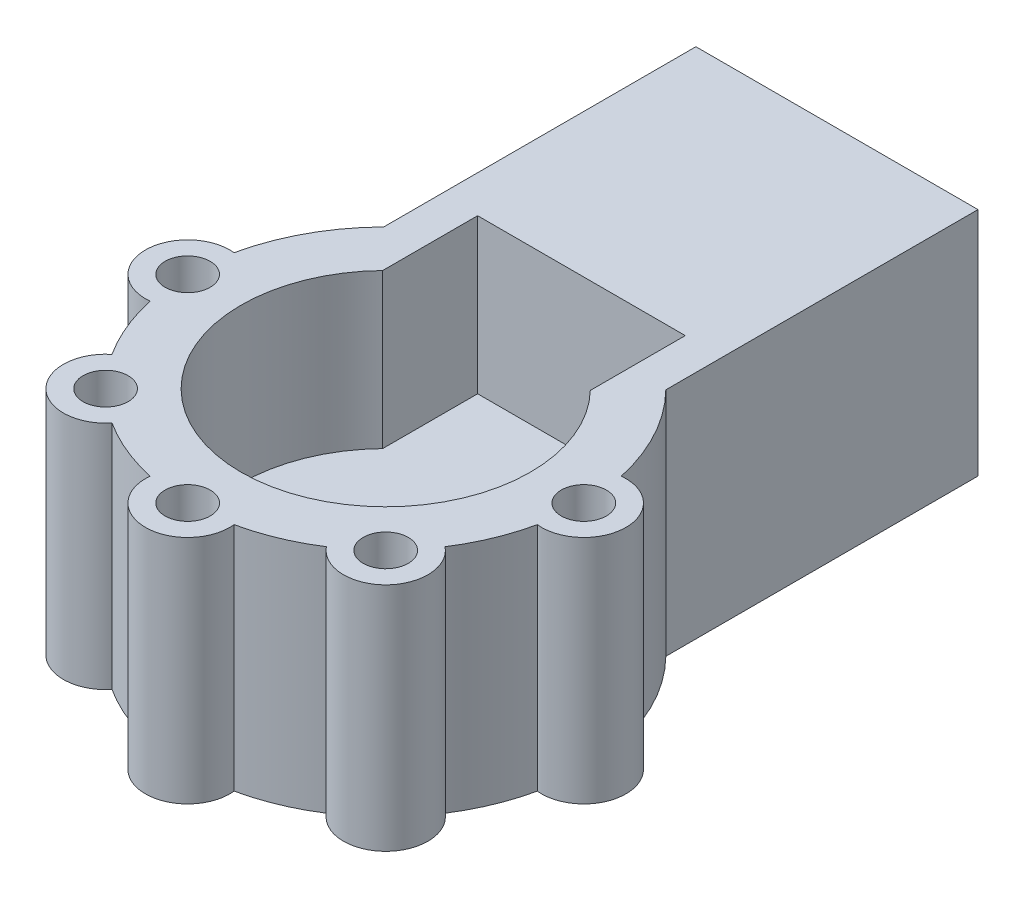
ISO-10303-21;
HEADER;
FILE_DESCRIPTION(('STEP AP214'),'2;1');
FILE_NAME('part.step','',(''),(''),'','','');
FILE_SCHEMA(('AUTOMOTIVE_DESIGN { 1 0 10303 214 1 1 1 1 }'));
ENDSEC;
DATA;
#1=APPLICATION_CONTEXT('core data for automotive mechanical design processes');
#2=APPLICATION_PROTOCOL_DEFINITION('international standard','automotive_design',2000,#1);
#3=PRODUCT_CONTEXT('',#1,'mechanical');
#4=PRODUCT('Part','Part','',(#3));
#5=PRODUCT_RELATED_PRODUCT_CATEGORY('part','',(#4));
#6=PRODUCT_DEFINITION_FORMATION('','',#4);
#7=PRODUCT_DEFINITION_CONTEXT('part definition',#1,'design');
#8=PRODUCT_DEFINITION('design','',#6,#7);
#9=PRODUCT_DEFINITION_SHAPE('','',#8);
#10=(LENGTH_UNIT() NAMED_UNIT(*) SI_UNIT(.MILLI.,.METRE.));
#11=(NAMED_UNIT(*) PLANE_ANGLE_UNIT() SI_UNIT($,.RADIAN.));
#12=(NAMED_UNIT(*) SI_UNIT($,.STERADIAN.) SOLID_ANGLE_UNIT());
#13=UNCERTAINTY_MEASURE_WITH_UNIT(LENGTH_MEASURE(1.E-05),#10,'distance_accuracy_value','');
#14=(GEOMETRIC_REPRESENTATION_CONTEXT(3) GLOBAL_UNCERTAINTY_ASSIGNED_CONTEXT((#13)) GLOBAL_UNIT_ASSIGNED_CONTEXT((#10,
#11,#12)) REPRESENTATION_CONTEXT('',''));
#15=CARTESIAN_POINT('',(0.,0.,0.));
#16=DIRECTION('',(0.,0.,1.));
#17=DIRECTION('',(1.,0.,0.));
#18=AXIS2_PLACEMENT_3D('',#15,#16,#17);
#19=CARTESIAN_POINT('',(-72.4336404409439,59.2626048963925,125.));
#20=DIRECTION('',(0.,-1.,0.));
#21=DIRECTION('',(0.,0.,-1.));
#22=AXIS2_PLACEMENT_3D('',#19,#20,#21);
#23=PLANE('',#22);
#24=CARTESIAN_POINT('',(71.9237510236151,59.2626048963925,303.64297723897));
#25=DIRECTION('',(0.,1.,0.));
#26=DIRECTION('',(0.,0.,1.));
#27=AXIS2_PLACEMENT_3D('',#24,#25,#26);
#28=CIRCLE('',#27,11.5757003126509);
#29=CARTESIAN_POINT('',(71.9237510236151,59.2626048963925,315.218677551621));
#30=VERTEX_POINT('',#29);
#31=EDGE_CURVE('E186',#30,#30,#28,.T.);
#32=ORIENTED_EDGE('',*,*,#31,.F.);
#33=EDGE_LOOP('',(#32));
#34=FACE_BOUND('',#33,.T.);
#35=CARTESIAN_POINT('',(101.715544154344,59.2626048963925,231.719226215354));
#36=DIRECTION('',(0.,1.,0.));
#37=DIRECTION('',(0.,0.,1.));
#38=AXIS2_PLACEMENT_3D('',#35,#36,#37);
#39=CIRCLE('',#38,11.5757003126509);
#40=CARTESIAN_POINT('',(101.715544154344,59.2626048963925,243.294926528005));
#41=VERTEX_POINT('',#40);
#42=EDGE_CURVE('E190',#41,#41,#39,.T.);
#43=ORIENTED_EDGE('',*,*,#42,.F.);
#44=EDGE_LOOP('',(#43));
#45=FACE_BOUND('',#44,.T.);
#46=CARTESIAN_POINT('',(-101.715544154344,59.2626048963925,231.719226215353));
#47=DIRECTION('',(0.,1.,0.));
#48=DIRECTION('',(0.,0.,1.));
#49=AXIS2_PLACEMENT_3D('',#46,#47,#48);
#50=CIRCLE('',#49,11.5757003126509);
#51=CARTESIAN_POINT('',(-101.715544154344,59.2626048963925,243.294926528004));
#52=VERTEX_POINT('',#51);
#53=EDGE_CURVE('E235',#52,#52,#50,.T.);
#54=ORIENTED_EDGE('',*,*,#53,.F.);
#55=EDGE_LOOP('',(#54));
#56=FACE_BOUND('',#55,.T.);
#57=CARTESIAN_POINT('',(-71.9237510236161,59.2626048963925,303.642977238969));
#58=DIRECTION('',(0.,1.,0.));
#59=DIRECTION('',(0.,0.,1.));
#60=AXIS2_PLACEMENT_3D('',#57,#58,#59);
#61=CIRCLE('',#60,11.5757003126509);
#62=CARTESIAN_POINT('',(-71.9237510236161,59.2626048963925,315.21867755162));
#63=VERTEX_POINT('',#62);
#64=EDGE_CURVE('E238',#63,#63,#61,.T.);
#65=ORIENTED_EDGE('',*,*,#64,.F.);
#66=EDGE_LOOP('',(#65));
#67=FACE_BOUND('',#66,.T.);
#68=CARTESIAN_POINT('',(0.,59.2626048963925,333.434770369697));
#69=DIRECTION('',(0.,1.,0.));
#70=DIRECTION('',(0.,0.,1.));
#71=AXIS2_PLACEMENT_3D('',#68,#69,#70);
#72=CIRCLE('',#71,11.5757003126509);
#73=CARTESIAN_POINT('',(0.,59.2626048963925,345.010470682348));
#74=VERTEX_POINT('',#73);
#75=EDGE_CURVE('E241',#74,#74,#72,.T.);
#76=ORIENTED_EDGE('',*,*,#75,.F.);
#77=EDGE_LOOP('',(#76));
#78=FACE_BOUND('',#77,.T.);
#79=DIRECTION('',(0.,0.,-1.));
#80=VECTOR('',#79,1.);
#81=CARTESIAN_POINT('',(-72.4336404409439,59.2626048963925,125.));
#82=LINE('',#81,#80);
#83=CARTESIAN_POINT('',(-72.4336404409439,59.2626048963925,0.));
#84=VERTEX_POINT('',#83);
#85=CARTESIAN_POINT('',(-72.4336404409439,59.2626048963925,160.309005272646));
#86=VERTEX_POINT('',#85);
#87=EDGE_CURVE('E42',#84,#86,#82,.F.);
#88=ORIENTED_EDGE('',*,*,#87,.T.);
#89=CARTESIAN_POINT('',(0.,59.2626048963925,231.719226215353));
#90=DIRECTION('',(0.,1.,0.));
#91=DIRECTION('',(0.,0.,1.));
#92=AXIS2_PLACEMENT_3D('',#89,#90,#91);
#93=CIRCLE('',#92,101.715544154344);
#94=CARTESIAN_POINT('',(-99.4043282418894,59.2626048963925,210.159276090343));
#95=VERTEX_POINT('',#94);
#96=EDGE_CURVE('E268',#86,#95,#93,.T.);
#97=ORIENTED_EDGE('',*,*,#96,.T.);
#98=CARTESIAN_POINT('',(-101.715544154344,59.2626048963925,231.719226215353));
#99=DIRECTION('',(0.,1.,0.));
#100=DIRECTION('',(0.,0.,1.));
#101=AXIS2_PLACEMENT_3D('',#98,#99,#100);
#102=CIRCLE('',#101,21.6834768518998);
#103=CARTESIAN_POINT('',(-99.4043282418896,59.2626048963925,253.279176340362));
#104=VERTEX_POINT('',#103);
#105=EDGE_CURVE('E272',#95,#104,#102,.T.);
#106=ORIENTED_EDGE('',*,*,#105,.T.);
#107=CARTESIAN_POINT('',(0.,59.2626048963925,231.719226215353));
#108=DIRECTION('',(0.,1.,0.));
#109=DIRECTION('',(0.,0.,1.));
#110=AXIS2_PLACEMENT_3D('',#107,#108,#109);
#111=CIRCLE('',#110,101.715544154344);
#112=CARTESIAN_POINT('',(-85.5346615145714,59.2626048963925,286.763513859049));
#113=VERTEX_POINT('',#112);
#114=EDGE_CURVE('E244',#104,#113,#111,.T.);
#115=ORIENTED_EDGE('',*,*,#114,.T.);
#116=CARTESIAN_POINT('',(-71.9237510236161,59.2626048963925,303.642977238969));
#117=DIRECTION('',(0.,1.,0.));
#118=DIRECTION('',(0.,0.,1.));
#119=AXIS2_PLACEMENT_3D('',#116,#117,#118);
#120=CIRCLE('',#119,21.6834768518996);
#121=CARTESIAN_POINT('',(-55.0442876436959,59.2626048963925,317.253887729924));
#122=VERTEX_POINT('',#121);
#123=EDGE_CURVE('E247',#113,#122,#120,.T.);
#124=ORIENTED_EDGE('',*,*,#123,.T.);
#125=CARTESIAN_POINT('',(0.,59.2626048963925,231.719226215353));
#126=DIRECTION('',(0.,1.,0.));
#127=DIRECTION('',(0.,0.,1.));
#128=AXIS2_PLACEMENT_3D('',#125,#126,#127);
#129=CIRCLE('',#128,101.715544154344);
#130=CARTESIAN_POINT('',(-21.5599501250093,59.2626048963925,331.123554457243));
#131=VERTEX_POINT('',#130);
#132=EDGE_CURVE('E250',#122,#131,#129,.T.);
#133=ORIENTED_EDGE('',*,*,#132,.T.);
#134=CARTESIAN_POINT('',(0.,59.2626048963925,333.434770369697));
#135=DIRECTION('',(0.,1.,0.));
#136=DIRECTION('',(0.,0.,1.));
#137=AXIS2_PLACEMENT_3D('',#134,#135,#136);
#138=CIRCLE('',#137,21.6834768518996);
#139=CARTESIAN_POINT('',(21.5599501250093,59.2626048963925,331.123554457243));
#140=VERTEX_POINT('',#139);
#141=EDGE_CURVE('E253',#131,#140,#138,.T.);
#142=ORIENTED_EDGE('',*,*,#141,.T.);
#143=CARTESIAN_POINT('',(0.,59.2626048963925,231.719226215353));
#144=DIRECTION('',(0.,1.,0.));
#145=DIRECTION('',(0.,0.,1.));
#146=AXIS2_PLACEMENT_3D('',#143,#144,#145);
#147=CIRCLE('',#146,101.715544154344);
#148=CARTESIAN_POINT('',(55.0442876436946,59.2626048963925,317.253887729925));
#149=VERTEX_POINT('',#148);
#150=EDGE_CURVE('E256',#140,#149,#147,.T.);
#151=ORIENTED_EDGE('',*,*,#150,.T.);
#152=CARTESIAN_POINT('',(71.9237510236151,59.2626048963925,303.64297723897));
#153=DIRECTION('',(0.,1.,0.));
#154=DIRECTION('',(0.,0.,1.));
#155=AXIS2_PLACEMENT_3D('',#152,#153,#154);
#156=CIRCLE('',#155,21.6834768518998);
#157=CARTESIAN_POINT('',(85.5346615145707,59.2626048963925,286.76351385905));
#158=VERTEX_POINT('',#157);
#159=EDGE_CURVE('E259',#149,#158,#156,.T.);
#160=ORIENTED_EDGE('',*,*,#159,.T.);
#161=CARTESIAN_POINT('',(0.,59.2626048963925,231.719226215353));
#162=DIRECTION('',(0.,1.,0.));
#163=DIRECTION('',(0.,0.,1.));
#164=AXIS2_PLACEMENT_3D('',#161,#162,#163);
#165=CIRCLE('',#164,101.715544154344);
#166=CARTESIAN_POINT('',(99.4043282418893,59.2626048963925,253.279176340364));
#167=VERTEX_POINT('',#166);
#168=EDGE_CURVE('E262',#158,#167,#165,.T.);
#169=ORIENTED_EDGE('',*,*,#168,.T.);
#170=CARTESIAN_POINT('',(101.715544154344,59.2626048963925,231.719226215354));
#171=DIRECTION('',(0.,1.,0.));
#172=DIRECTION('',(0.,0.,1.));
#173=AXIS2_PLACEMENT_3D('',#170,#171,#172);
#174=CIRCLE('',#173,21.6834768518998);
#175=CARTESIAN_POINT('',(99.4043282418898,59.2626048963925,210.159276090345));
#176=VERTEX_POINT('',#175);
#177=EDGE_CURVE('E265',#167,#176,#174,.T.);
#178=ORIENTED_EDGE('',*,*,#177,.T.);
#179=CARTESIAN_POINT('',(72.4336404409439,59.2626048963925,160.309005272646));
#180=VERTEX_POINT('',#179);
#181=EDGE_CURVE('E269',#176,#180,#93,.T.);
#182=ORIENTED_EDGE('',*,*,#181,.T.);
#183=DIRECTION('',(0.,0.,1.));
#184=VECTOR('',#183,1.);
#185=CARTESIAN_POINT('',(72.4336404409439,59.2626048963925,125.));
#186=LINE('',#185,#184);
#187=CARTESIAN_POINT('',(72.4336404409439,59.2626048963925,0.));
#188=VERTEX_POINT('',#187);
#189=EDGE_CURVE('E310',#180,#188,#186,.F.);
#190=ORIENTED_EDGE('',*,*,#189,.T.);
#191=DIRECTION('',(1.,0.,0.));
#192=VECTOR('',#191,1.);
#193=CARTESIAN_POINT('',(0.,59.2626048963925,0.));
#194=LINE('',#193,#192);
#195=EDGE_CURVE('E308',#188,#84,#194,.F.);
#196=ORIENTED_EDGE('',*,*,#195,.T.);
#197=EDGE_LOOP('',(#88,#97,#106,#115,#124,#133,#142,#151,#160,#169,#178,#182,#190,#196));
#198=FACE_BOUND('',#197,.T.);
#199=DIRECTION('',(0.,0.,-1.));
#200=VECTOR('',#199,1.);
#201=CARTESIAN_POINT('',(-53.3206547201814,59.2626048963925,179.962169425374));
#202=LINE('',#201,#200);
#203=CARTESIAN_POINT('',(-53.3206547201814,59.2626048963925,179.962169425374));
#204=VERTEX_POINT('',#203);
#205=CARTESIAN_POINT('',(-53.3206547201814,59.2626048963925,131.207582727193));
#206=VERTEX_POINT('',#205);
#207=EDGE_CURVE('E55',#204,#206,#202,.T.);
#208=ORIENTED_EDGE('',*,*,#207,.T.);
#209=DIRECTION('',(1.,0.,0.));
#210=VECTOR('',#209,1.);
#211=CARTESIAN_POINT('',(-53.3206547201814,59.2626048963925,131.207582727193));
#212=LINE('',#211,#210);
#213=CARTESIAN_POINT('',(53.3206547201814,59.2626048963925,131.207582727193));
#214=VERTEX_POINT('',#213);
#215=EDGE_CURVE('E185',#206,#214,#212,.T.);
#216=ORIENTED_EDGE('',*,*,#215,.T.);
#217=DIRECTION('',(0.,0.,-1.));
#218=VECTOR('',#217,1.);
#219=CARTESIAN_POINT('',(53.3206547201814,59.2626048963925,179.962169425374));
#220=LINE('',#219,#218);
#221=CARTESIAN_POINT('',(53.3206547201815,59.2626048963925,179.962169425374));
#222=VERTEX_POINT('',#221);
#223=EDGE_CURVE('E601',#222,#214,#220,.T.);
#224=ORIENTED_EDGE('',*,*,#223,.F.);
#225=CARTESIAN_POINT('',(0.,59.2626048963925,231.719226215353));
#226=DIRECTION('',(0.,1.,0.));
#227=DIRECTION('',(0.,0.,1.));
#228=AXIS2_PLACEMENT_3D('',#225,#226,#227);
#229=CIRCLE('',#228,74.3093880162522);
#230=EDGE_CURVE('E181',#204,#222,#229,.T.);
#231=ORIENTED_EDGE('',*,*,#230,.F.);
#232=EDGE_LOOP('',(#208,#216,#224,#231));
#233=FACE_BOUND('',#232,.T.);
#234=ADVANCED_FACE('F39',(#34,#45,#56,#67,#78,#198,#233),#23,.F.);
#235=CARTESIAN_POINT('',(-72.4336404409439,59.2626048963925,125.));
#236=DIRECTION('',(1.,0.,0.));
#237=DIRECTION('',(0.,0.,-1.));
#238=AXIS2_PLACEMENT_3D('',#235,#236,#237);
#239=PLANE('',#238);
#240=DIRECTION('',(0.,0.,1.));
#241=VECTOR('',#240,1.);
#242=CARTESIAN_POINT('',(-72.4336404409439,-59.2626048963925,125.));
#243=LINE('',#242,#241);
#244=CARTESIAN_POINT('',(-72.4336404409439,-59.2626048963925,0.));
#245=VERTEX_POINT('',#244);
#246=CARTESIAN_POINT('',(-72.4336404409439,-59.2626048963925,160.309005272646));
#247=VERTEX_POINT('',#246);
#248=EDGE_CURVE('E300',#245,#247,#243,.T.);
#249=ORIENTED_EDGE('',*,*,#248,.T.);
#250=DIRECTION('',(0.,1.,0.));
#251=VECTOR('',#250,1.);
#252=CARTESIAN_POINT('',(-72.4336404409439,-393.307274048045,160.309005272646));
#253=LINE('',#252,#251);
#254=EDGE_CURVE('E63',#247,#86,#253,.T.);
#255=ORIENTED_EDGE('',*,*,#254,.T.);
#256=ORIENTED_EDGE('',*,*,#87,.F.);
#257=DIRECTION('',(0.,1.,0.));
#258=VECTOR('',#257,1.);
#259=CARTESIAN_POINT('',(-72.4336404409439,0.,0.));
#260=LINE('',#259,#258);
#261=EDGE_CURVE('E305',#84,#245,#260,.F.);
#262=ORIENTED_EDGE('',*,*,#261,.T.);
#263=EDGE_LOOP('',(#249,#255,#256,#262));
#264=FACE_BOUND('',#263,.T.);
#265=ADVANCED_FACE('F380',(#264),#239,.F.);
#266=CARTESIAN_POINT('',(72.4336404409439,59.2626048963925,125.));
#267=DIRECTION('',(-1.,0.,0.));
#268=DIRECTION('',(0.,0.,1.));
#269=AXIS2_PLACEMENT_3D('',#266,#267,#268);
#270=PLANE('',#269);
#271=ORIENTED_EDGE('',*,*,#189,.F.);
#272=DIRECTION('',(0.,1.,0.));
#273=VECTOR('',#272,1.);
#274=CARTESIAN_POINT('',(72.4336404409439,-393.307274048045,160.309005272646));
#275=LINE('',#274,#273);
#276=CARTESIAN_POINT('',(72.4336404409439,-59.2626048963925,160.309005272646));
#277=VERTEX_POINT('',#276);
#278=EDGE_CURVE('E210',#180,#277,#275,.F.);
#279=ORIENTED_EDGE('',*,*,#278,.T.);
#280=DIRECTION('',(0.,0.,1.));
#281=VECTOR('',#280,1.);
#282=CARTESIAN_POINT('',(72.4336404409439,-59.2626048963925,125.));
#283=LINE('',#282,#281);
#284=CARTESIAN_POINT('',(72.4336404409439,-59.2626048963925,0.));
#285=VERTEX_POINT('',#284);
#286=EDGE_CURVE('E47',#277,#285,#283,.F.);
#287=ORIENTED_EDGE('',*,*,#286,.T.);
#288=DIRECTION('',(0.,1.,0.));
#289=VECTOR('',#288,1.);
#290=CARTESIAN_POINT('',(72.4336404409439,0.,0.));
#291=LINE('',#290,#289);
#292=EDGE_CURVE('E302',#285,#188,#291,.T.);
#293=ORIENTED_EDGE('',*,*,#292,.T.);
#294=EDGE_LOOP('',(#271,#279,#287,#293));
#295=FACE_BOUND('',#294,.T.);
#296=ADVANCED_FACE('F372',(#295),#270,.F.);
#297=CARTESIAN_POINT('',(0.,0.,0.));
#298=DIRECTION('',(0.,0.,1.));
#299=DIRECTION('',(1.,0.,0.));
#300=AXIS2_PLACEMENT_3D('',#297,#298,#299);
#301=PLANE('',#300);
#302=DIRECTION('',(1.,0.,0.));
#303=VECTOR('',#302,1.);
#304=CARTESIAN_POINT('',(-72.4336404409439,-59.2626048963925,0.));
#305=LINE('',#304,#303);
#306=EDGE_CURVE('E11',#285,#245,#305,.F.);
#307=ORIENTED_EDGE('',*,*,#306,.T.);
#308=ORIENTED_EDGE('',*,*,#261,.F.);
#309=ORIENTED_EDGE('',*,*,#195,.F.);
#310=ORIENTED_EDGE('',*,*,#292,.F.);
#311=EDGE_LOOP('',(#307,#308,#309,#310));
#312=FACE_BOUND('',#311,.T.);
#313=ADVANCED_FACE('F379',(#312),#301,.F.);
#314=CARTESIAN_POINT('',(-72.4336404409439,-59.2626048963925,125.));
#315=DIRECTION('',(0.,1.,0.));
#316=DIRECTION('',(0.,0.,1.));
#317=AXIS2_PLACEMENT_3D('',#314,#315,#316);
#318=PLANE('',#317);
#319=ORIENTED_EDGE('',*,*,#286,.F.);
#320=CARTESIAN_POINT('',(0.,-59.2626048963925,231.719226215353));
#321=DIRECTION('',(0.,1.,0.));
#322=DIRECTION('',(0.,0.,1.));
#323=AXIS2_PLACEMENT_3D('',#320,#321,#322);
#324=CIRCLE('',#323,101.715544154344);
#325=CARTESIAN_POINT('',(99.4043282418898,-59.2626048963925,210.159276090345));
#326=VERTEX_POINT('',#325);
#327=EDGE_CURVE('E226',#277,#326,#324,.F.);
#328=ORIENTED_EDGE('',*,*,#327,.T.);
#329=CARTESIAN_POINT('',(101.715544154344,-59.2626048963925,231.719226215354));
#330=DIRECTION('',(0.,1.,0.));
#331=DIRECTION('',(0.,0.,1.));
#332=AXIS2_PLACEMENT_3D('',#329,#330,#331);
#333=CIRCLE('',#332,21.6834768518998);
#334=CARTESIAN_POINT('',(99.4043282418893,-59.2626048963925,253.279176340364));
#335=VERTEX_POINT('',#334);
#336=EDGE_CURVE('E224',#326,#335,#333,.F.);
#337=ORIENTED_EDGE('',*,*,#336,.T.);
#338=CARTESIAN_POINT('',(0.,-59.2626048963925,231.719226215353));
#339=DIRECTION('',(0.,1.,0.));
#340=DIRECTION('',(0.,0.,1.));
#341=AXIS2_PLACEMENT_3D('',#338,#339,#340);
#342=CIRCLE('',#341,101.715544154344);
#343=CARTESIAN_POINT('',(85.5346615145707,-59.2626048963925,286.76351385905));
#344=VERTEX_POINT('',#343);
#345=EDGE_CURVE('E222',#335,#344,#342,.F.);
#346=ORIENTED_EDGE('',*,*,#345,.T.);
#347=CARTESIAN_POINT('',(71.9237510236151,-59.2626048963925,303.64297723897));
#348=DIRECTION('',(0.,1.,0.));
#349=DIRECTION('',(0.,0.,1.));
#350=AXIS2_PLACEMENT_3D('',#347,#348,#349);
#351=CIRCLE('',#350,21.6834768518998);
#352=CARTESIAN_POINT('',(55.0442876436946,-59.2626048963925,317.253887729925));
#353=VERTEX_POINT('',#352);
#354=EDGE_CURVE('E220',#344,#353,#351,.F.);
#355=ORIENTED_EDGE('',*,*,#354,.T.);
#356=CARTESIAN_POINT('',(0.,-59.2626048963925,231.719226215353));
#357=DIRECTION('',(0.,1.,0.));
#358=DIRECTION('',(0.,0.,1.));
#359=AXIS2_PLACEMENT_3D('',#356,#357,#358);
#360=CIRCLE('',#359,101.715544154344);
#361=CARTESIAN_POINT('',(21.5599501250093,-59.2626048963925,331.123554457243));
#362=VERTEX_POINT('',#361);
#363=EDGE_CURVE('E218',#353,#362,#360,.F.);
#364=ORIENTED_EDGE('',*,*,#363,.T.);
#365=CARTESIAN_POINT('',(0.,-59.2626048963925,333.434770369697));
#366=DIRECTION('',(0.,1.,0.));
#367=DIRECTION('',(0.,0.,1.));
#368=AXIS2_PLACEMENT_3D('',#365,#366,#367);
#369=CIRCLE('',#368,21.6834768518996);
#370=CARTESIAN_POINT('',(-21.5599501250093,-59.2626048963925,331.123554457243));
#371=VERTEX_POINT('',#370);
#372=EDGE_CURVE('E215',#362,#371,#369,.F.);
#373=ORIENTED_EDGE('',*,*,#372,.T.);
#374=CARTESIAN_POINT('',(0.,-59.2626048963925,231.719226215353));
#375=DIRECTION('',(0.,1.,0.));
#376=DIRECTION('',(0.,0.,1.));
#377=AXIS2_PLACEMENT_3D('',#374,#375,#376);
#378=CIRCLE('',#377,101.715544154344);
#379=CARTESIAN_POINT('',(-55.0442876436959,-59.2626048963925,317.253887729924));
#380=VERTEX_POINT('',#379);
#381=EDGE_CURVE('E213',#371,#380,#378,.F.);
#382=ORIENTED_EDGE('',*,*,#381,.T.);
#383=CARTESIAN_POINT('',(-71.9237510236161,-59.2626048963925,303.642977238969));
#384=DIRECTION('',(0.,1.,0.));
#385=DIRECTION('',(0.,0.,1.));
#386=AXIS2_PLACEMENT_3D('',#383,#384,#385);
#387=CIRCLE('',#386,21.6834768518996);
#388=CARTESIAN_POINT('',(-85.5346615145714,-59.2626048963925,286.763513859049));
#389=VERTEX_POINT('',#388);
#390=EDGE_CURVE('E207',#380,#389,#387,.F.);
#391=ORIENTED_EDGE('',*,*,#390,.T.);
#392=CARTESIAN_POINT('',(0.,-59.2626048963925,231.719226215353));
#393=DIRECTION('',(0.,1.,0.));
#394=DIRECTION('',(0.,0.,1.));
#395=AXIS2_PLACEMENT_3D('',#392,#393,#394);
#396=CIRCLE('',#395,101.715544154344);
#397=CARTESIAN_POINT('',(-99.4043282418896,-59.2626048963925,253.279176340362));
#398=VERTEX_POINT('',#397);
#399=EDGE_CURVE('E212',#389,#398,#396,.F.);
#400=ORIENTED_EDGE('',*,*,#399,.T.);
#401=CARTESIAN_POINT('',(-101.715544154344,-59.2626048963925,231.719226215353));
#402=DIRECTION('',(0.,1.,0.));
#403=DIRECTION('',(0.,0.,1.));
#404=AXIS2_PLACEMENT_3D('',#401,#402,#403);
#405=CIRCLE('',#404,21.6834768518998);
#406=CARTESIAN_POINT('',(-99.4043282418894,-59.2626048963925,210.159276090343));
#407=VERTEX_POINT('',#406);
#408=EDGE_CURVE('E230',#398,#407,#405,.F.);
#409=ORIENTED_EDGE('',*,*,#408,.T.);
#410=EDGE_CURVE('E227',#407,#247,#324,.F.);
#411=ORIENTED_EDGE('',*,*,#410,.T.);
#412=ORIENTED_EDGE('',*,*,#248,.F.);
#413=ORIENTED_EDGE('',*,*,#306,.F.);
#414=EDGE_LOOP('',(#319,#328,#337,#346,#355,#364,#373,#382,#391,#400,#409,#411,#412,#413));
#415=FACE_BOUND('',#414,.T.);
#416=CARTESIAN_POINT('',(0.,-59.2626048963925,333.434770369697));
#417=DIRECTION('',(0.,1.,0.));
#418=DIRECTION('',(0.,0.,1.));
#419=AXIS2_PLACEMENT_3D('',#416,#417,#418);
#420=CIRCLE('',#419,11.5757003126509);
#421=CARTESIAN_POINT('',(0.,-59.2626048963925,345.010470682348));
#422=VERTEX_POINT('',#421);
#423=EDGE_CURVE('E204',#422,#422,#420,.F.);
#424=ORIENTED_EDGE('',*,*,#423,.F.);
#425=EDGE_LOOP('',(#424));
#426=FACE_BOUND('',#425,.T.);
#427=CARTESIAN_POINT('',(-101.715544154344,-59.2626048963925,231.719226215353));
#428=DIRECTION('',(0.,1.,0.));
#429=DIRECTION('',(0.,0.,1.));
#430=AXIS2_PLACEMENT_3D('',#427,#428,#429);
#431=CIRCLE('',#430,11.5757003126509);
#432=CARTESIAN_POINT('',(-101.715544154344,-59.2626048963925,243.294926528004));
#433=VERTEX_POINT('',#432);
#434=EDGE_CURVE('E201',#433,#433,#431,.F.);
#435=ORIENTED_EDGE('',*,*,#434,.F.);
#436=EDGE_LOOP('',(#435));
#437=FACE_BOUND('',#436,.T.);
#438=CARTESIAN_POINT('',(71.9237510236151,-59.2626048963925,303.64297723897));
#439=DIRECTION('',(0.,1.,0.));
#440=DIRECTION('',(0.,0.,1.));
#441=AXIS2_PLACEMENT_3D('',#438,#439,#440);
#442=CIRCLE('',#441,11.5757003126509);
#443=CARTESIAN_POINT('',(71.9237510236151,-59.2626048963925,315.218677551621));
#444=VERTEX_POINT('',#443);
#445=EDGE_CURVE('E199',#444,#444,#442,.F.);
#446=ORIENTED_EDGE('',*,*,#445,.F.);
#447=EDGE_LOOP('',(#446));
#448=FACE_BOUND('',#447,.T.);
#449=CARTESIAN_POINT('',(101.715544154344,-59.2626048963925,231.719226215354));
#450=DIRECTION('',(0.,1.,0.));
#451=DIRECTION('',(0.,0.,1.));
#452=AXIS2_PLACEMENT_3D('',#449,#450,#451);
#453=CIRCLE('',#452,11.5757003126509);
#454=CARTESIAN_POINT('',(101.715544154344,-59.2626048963925,243.294926528005));
#455=VERTEX_POINT('',#454);
#456=EDGE_CURVE('E196',#455,#455,#453,.F.);
#457=ORIENTED_EDGE('',*,*,#456,.F.);
#458=EDGE_LOOP('',(#457));
#459=FACE_BOUND('',#458,.T.);
#460=CARTESIAN_POINT('',(-71.9237510236161,-59.2626048963925,303.642977238969));
#461=DIRECTION('',(0.,1.,0.));
#462=DIRECTION('',(0.,0.,1.));
#463=AXIS2_PLACEMENT_3D('',#460,#461,#462);
#464=CIRCLE('',#463,11.5757003126509);
#465=CARTESIAN_POINT('',(-71.9237510236161,-59.2626048963925,315.21867755162));
#466=VERTEX_POINT('',#465);
#467=EDGE_CURVE('E200',#466,#466,#464,.F.);
#468=ORIENTED_EDGE('',*,*,#467,.F.);
#469=EDGE_LOOP('',(#468));
#470=FACE_BOUND('',#469,.T.);
#471=ADVANCED_FACE('F376',(#415,#426,#437,#448,#459,#470),#318,.F.);
#472=CARTESIAN_POINT('',(0.,-393.307274048045,231.719226215353));
#473=DIRECTION('',(0.,1.,0.));
#474=DIRECTION('',(0.,0.,1.));
#475=AXIS2_PLACEMENT_3D('',#472,#473,#474);
#476=CYLINDRICAL_SURFACE('',#475,101.715544154344);
#477=ORIENTED_EDGE('',*,*,#254,.F.);
#478=ORIENTED_EDGE('',*,*,#410,.F.);
#479=DIRECTION('',(0.,1.,0.));
#480=VECTOR('',#479,1.);
#481=CARTESIAN_POINT('',(-99.4043282418894,-393.307274048045,210.159276090343));
#482=LINE('',#481,#480);
#483=EDGE_CURVE('E277',#407,#95,#482,.T.);
#484=ORIENTED_EDGE('',*,*,#483,.T.);
#485=ORIENTED_EDGE('',*,*,#96,.F.);
#486=EDGE_LOOP('',(#477,#478,#484,#485));
#487=FACE_BOUND('',#486,.T.);
#488=ADVANCED_FACE('F317',(#487),#476,.T.);
#489=ORIENTED_EDGE('',*,*,#278,.F.);
#490=ORIENTED_EDGE('',*,*,#181,.F.);
#491=DIRECTION('',(0.,1.,0.));
#492=VECTOR('',#491,1.);
#493=CARTESIAN_POINT('',(99.4043282418898,-393.307274048045,210.159276090345));
#494=LINE('',#493,#492);
#495=EDGE_CURVE('E280',#326,#176,#494,.T.);
#496=ORIENTED_EDGE('',*,*,#495,.F.);
#497=ORIENTED_EDGE('',*,*,#327,.F.);
#498=EDGE_LOOP('',(#489,#490,#496,#497));
#499=FACE_BOUND('',#498,.T.);
#500=ADVANCED_FACE('F369',(#499),#476,.T.);
#501=CARTESIAN_POINT('',(-71.9237510236161,-393.307274048045,303.642977238969));
#502=DIRECTION('',(0.,1.,0.));
#503=DIRECTION('',(0.,0.,1.));
#504=AXIS2_PLACEMENT_3D('',#501,#502,#503);
#505=CYLINDRICAL_SURFACE('',#504,21.6834768518996);
#506=ORIENTED_EDGE('',*,*,#390,.F.);
#507=DIRECTION('',(0.,1.,0.));
#508=VECTOR('',#507,1.);
#509=CARTESIAN_POINT('',(-55.0442876436959,-393.307274048045,317.253887729924));
#510=LINE('',#509,#508);
#511=EDGE_CURVE('E292',#380,#122,#510,.T.);
#512=ORIENTED_EDGE('',*,*,#511,.T.);
#513=ORIENTED_EDGE('',*,*,#123,.F.);
#514=DIRECTION('',(0.,1.,0.));
#515=VECTOR('',#514,1.);
#516=CARTESIAN_POINT('',(-85.5346615145714,-393.307274048045,286.763513859049));
#517=LINE('',#516,#515);
#518=EDGE_CURVE('E275',#389,#113,#517,.T.);
#519=ORIENTED_EDGE('',*,*,#518,.F.);
#520=EDGE_LOOP('',(#506,#512,#513,#519));
#521=FACE_BOUND('',#520,.T.);
#522=ADVANCED_FACE('F333',(#521),#505,.T.);
#523=CARTESIAN_POINT('',(0.,-393.307274048045,231.719226215353));
#524=DIRECTION('',(0.,1.,0.));
#525=DIRECTION('',(0.,0.,1.));
#526=AXIS2_PLACEMENT_3D('',#523,#524,#525);
#527=CYLINDRICAL_SURFACE('',#526,101.715544154344);
#528=ORIENTED_EDGE('',*,*,#381,.F.);
#529=DIRECTION('',(0.,1.,0.));
#530=VECTOR('',#529,1.);
#531=CARTESIAN_POINT('',(-21.5599501250093,-393.307274048045,331.123554457243));
#532=LINE('',#531,#530);
#533=EDGE_CURVE('E290',#371,#131,#532,.T.);
#534=ORIENTED_EDGE('',*,*,#533,.T.);
#535=ORIENTED_EDGE('',*,*,#132,.F.);
#536=ORIENTED_EDGE('',*,*,#511,.F.);
#537=EDGE_LOOP('',(#528,#534,#535,#536));
#538=FACE_BOUND('',#537,.T.);
#539=ADVANCED_FACE('F338',(#538),#527,.T.);
#540=CARTESIAN_POINT('',(0.,-393.307274048045,333.434770369697));
#541=DIRECTION('',(0.,1.,0.));
#542=DIRECTION('',(0.,0.,1.));
#543=AXIS2_PLACEMENT_3D('',#540,#541,#542);
#544=CYLINDRICAL_SURFACE('',#543,21.6834768518996);
#545=ORIENTED_EDGE('',*,*,#372,.F.);
#546=DIRECTION('',(0.,1.,0.));
#547=VECTOR('',#546,1.);
#548=CARTESIAN_POINT('',(21.5599501250093,-393.307274048045,331.123554457243));
#549=LINE('',#548,#547);
#550=EDGE_CURVE('E288',#362,#140,#549,.T.);
#551=ORIENTED_EDGE('',*,*,#550,.T.);
#552=ORIENTED_EDGE('',*,*,#141,.F.);
#553=ORIENTED_EDGE('',*,*,#533,.F.);
#554=EDGE_LOOP('',(#545,#551,#552,#553));
#555=FACE_BOUND('',#554,.T.);
#556=ADVANCED_FACE('F344',(#555),#544,.T.);
#557=CARTESIAN_POINT('',(0.,-393.307274048045,231.719226215353));
#558=DIRECTION('',(0.,1.,0.));
#559=DIRECTION('',(0.,0.,1.));
#560=AXIS2_PLACEMENT_3D('',#557,#558,#559);
#561=CYLINDRICAL_SURFACE('',#560,101.715544154344);
#562=ORIENTED_EDGE('',*,*,#363,.F.);
#563=DIRECTION('',(0.,1.,0.));
#564=VECTOR('',#563,1.);
#565=CARTESIAN_POINT('',(55.0442876436946,-393.307274048045,317.253887729925));
#566=LINE('',#565,#564);
#567=EDGE_CURVE('E286',#353,#149,#566,.T.);
#568=ORIENTED_EDGE('',*,*,#567,.T.);
#569=ORIENTED_EDGE('',*,*,#150,.F.);
#570=ORIENTED_EDGE('',*,*,#550,.F.);
#571=EDGE_LOOP('',(#562,#568,#569,#570));
#572=FACE_BOUND('',#571,.T.);
#573=ADVANCED_FACE('F348',(#572),#561,.T.);
#574=CARTESIAN_POINT('',(71.9237510236151,-393.307274048045,303.64297723897));
#575=DIRECTION('',(0.,1.,0.));
#576=DIRECTION('',(0.,0.,1.));
#577=AXIS2_PLACEMENT_3D('',#574,#575,#576);
#578=CYLINDRICAL_SURFACE('',#577,21.6834768518998);
#579=ORIENTED_EDGE('',*,*,#354,.F.);
#580=DIRECTION('',(0.,1.,0.));
#581=VECTOR('',#580,1.);
#582=CARTESIAN_POINT('',(85.5346615145707,-393.307274048045,286.76351385905));
#583=LINE('',#582,#581);
#584=EDGE_CURVE('E284',#344,#158,#583,.T.);
#585=ORIENTED_EDGE('',*,*,#584,.T.);
#586=ORIENTED_EDGE('',*,*,#159,.F.);
#587=ORIENTED_EDGE('',*,*,#567,.F.);
#588=EDGE_LOOP('',(#579,#585,#586,#587));
#589=FACE_BOUND('',#588,.T.);
#590=ADVANCED_FACE('F353',(#589),#578,.T.);
#591=CARTESIAN_POINT('',(0.,-393.307274048045,231.719226215353));
#592=DIRECTION('',(0.,1.,0.));
#593=DIRECTION('',(0.,0.,1.));
#594=AXIS2_PLACEMENT_3D('',#591,#592,#593);
#595=CYLINDRICAL_SURFACE('',#594,101.715544154344);
#596=ORIENTED_EDGE('',*,*,#345,.F.);
#597=DIRECTION('',(0.,1.,0.));
#598=VECTOR('',#597,1.);
#599=CARTESIAN_POINT('',(99.4043282418893,-393.307274048045,253.279176340364));
#600=LINE('',#599,#598);
#601=EDGE_CURVE('E282',#335,#167,#600,.T.);
#602=ORIENTED_EDGE('',*,*,#601,.T.);
#603=ORIENTED_EDGE('',*,*,#168,.F.);
#604=ORIENTED_EDGE('',*,*,#584,.F.);
#605=EDGE_LOOP('',(#596,#602,#603,#604));
#606=FACE_BOUND('',#605,.T.);
#607=ADVANCED_FACE('F359',(#606),#595,.T.);
#608=CARTESIAN_POINT('',(101.715544154344,-393.307274048045,231.719226215354));
#609=DIRECTION('',(0.,1.,0.));
#610=DIRECTION('',(0.,0.,1.));
#611=AXIS2_PLACEMENT_3D('',#608,#609,#610);
#612=CYLINDRICAL_SURFACE('',#611,21.6834768518998);
#613=ORIENTED_EDGE('',*,*,#336,.F.);
#614=ORIENTED_EDGE('',*,*,#495,.T.);
#615=ORIENTED_EDGE('',*,*,#177,.F.);
#616=ORIENTED_EDGE('',*,*,#601,.F.);
#617=EDGE_LOOP('',(#613,#614,#615,#616));
#618=FACE_BOUND('',#617,.T.);
#619=ADVANCED_FACE('F363',(#618),#612,.T.);
#620=CARTESIAN_POINT('',(-101.715544154344,-393.307274048045,231.719226215353));
#621=DIRECTION('',(0.,1.,0.));
#622=DIRECTION('',(0.,0.,1.));
#623=AXIS2_PLACEMENT_3D('',#620,#621,#622);
#624=CYLINDRICAL_SURFACE('',#623,21.6834768518998);
#625=ORIENTED_EDGE('',*,*,#408,.F.);
#626=DIRECTION('',(0.,1.,0.));
#627=VECTOR('',#626,1.);
#628=CARTESIAN_POINT('',(-99.4043282418896,-393.307274048045,253.279176340362));
#629=LINE('',#628,#627);
#630=EDGE_CURVE('E216',#398,#104,#629,.T.);
#631=ORIENTED_EDGE('',*,*,#630,.T.);
#632=ORIENTED_EDGE('',*,*,#105,.F.);
#633=ORIENTED_EDGE('',*,*,#483,.F.);
#634=EDGE_LOOP('',(#625,#631,#632,#633));
#635=FACE_BOUND('',#634,.T.);
#636=ADVANCED_FACE('F323',(#635),#624,.T.);
#637=CARTESIAN_POINT('',(0.,-393.307274048045,231.719226215353));
#638=DIRECTION('',(0.,1.,0.));
#639=DIRECTION('',(0.,0.,1.));
#640=AXIS2_PLACEMENT_3D('',#637,#638,#639);
#641=CYLINDRICAL_SURFACE('',#640,101.715544154344);
#642=ORIENTED_EDGE('',*,*,#399,.F.);
#643=ORIENTED_EDGE('',*,*,#518,.T.);
#644=ORIENTED_EDGE('',*,*,#114,.F.);
#645=ORIENTED_EDGE('',*,*,#630,.F.);
#646=EDGE_LOOP('',(#642,#643,#644,#645));
#647=FACE_BOUND('',#646,.T.);
#648=ADVANCED_FACE('F329',(#647),#641,.T.);
#649=CARTESIAN_POINT('',(0.,-393.307274048045,333.434770369697));
#650=DIRECTION('',(0.,1.,0.));
#651=DIRECTION('',(0.,0.,1.));
#652=AXIS2_PLACEMENT_3D('',#649,#650,#651);
#653=CYLINDRICAL_SURFACE('',#652,11.5757003126509);
#654=ORIENTED_EDGE('',*,*,#423,.T.);
#655=EDGE_LOOP('',(#654));
#656=FACE_BOUND('',#655,.T.);
#657=ORIENTED_EDGE('',*,*,#75,.T.);
#658=EDGE_LOOP('',(#657));
#659=FACE_BOUND('',#658,.T.);
#660=ADVANCED_FACE('F413',(#656,#659),#653,.F.);
#661=CARTESIAN_POINT('',(-71.9237510236161,-393.307274048045,303.642977238969));
#662=DIRECTION('',(0.,1.,0.));
#663=DIRECTION('',(0.,0.,1.));
#664=AXIS2_PLACEMENT_3D('',#661,#662,#663);
#665=CYLINDRICAL_SURFACE('',#664,11.5757003126509);
#666=ORIENTED_EDGE('',*,*,#467,.T.);
#667=EDGE_LOOP('',(#666));
#668=FACE_BOUND('',#667,.T.);
#669=ORIENTED_EDGE('',*,*,#64,.T.);
#670=EDGE_LOOP('',(#669));
#671=FACE_BOUND('',#670,.T.);
#672=ADVANCED_FACE('F503',(#668,#671),#665,.F.);
#673=CARTESIAN_POINT('',(-101.715544154344,-393.307274048045,231.719226215353));
#674=DIRECTION('',(0.,1.,0.));
#675=DIRECTION('',(0.,0.,1.));
#676=AXIS2_PLACEMENT_3D('',#673,#674,#675);
#677=CYLINDRICAL_SURFACE('',#676,11.5757003126509);
#678=ORIENTED_EDGE('',*,*,#434,.T.);
#679=EDGE_LOOP('',(#678));
#680=FACE_BOUND('',#679,.T.);
#681=ORIENTED_EDGE('',*,*,#53,.T.);
#682=EDGE_LOOP('',(#681));
#683=FACE_BOUND('',#682,.T.);
#684=ADVANCED_FACE('F512',(#680,#683),#677,.F.);
#685=CARTESIAN_POINT('',(101.715544154344,-393.307274048045,231.719226215354));
#686=DIRECTION('',(0.,1.,0.));
#687=DIRECTION('',(0.,0.,1.));
#688=AXIS2_PLACEMENT_3D('',#685,#686,#687);
#689=CYLINDRICAL_SURFACE('',#688,11.5757003126509);
#690=ORIENTED_EDGE('',*,*,#456,.T.);
#691=EDGE_LOOP('',(#690));
#692=FACE_BOUND('',#691,.T.);
#693=ORIENTED_EDGE('',*,*,#42,.T.);
#694=EDGE_LOOP('',(#693));
#695=FACE_BOUND('',#694,.T.);
#696=ADVANCED_FACE('F522',(#692,#695),#689,.F.);
#697=CARTESIAN_POINT('',(71.9237510236151,-393.307274048045,303.64297723897));
#698=DIRECTION('',(0.,1.,0.));
#699=DIRECTION('',(0.,0.,1.));
#700=AXIS2_PLACEMENT_3D('',#697,#698,#699);
#701=CYLINDRICAL_SURFACE('',#700,11.5757003126509);
#702=ORIENTED_EDGE('',*,*,#445,.T.);
#703=EDGE_LOOP('',(#702));
#704=FACE_BOUND('',#703,.T.);
#705=ORIENTED_EDGE('',*,*,#31,.T.);
#706=EDGE_LOOP('',(#705));
#707=FACE_BOUND('',#706,.T.);
#708=ADVANCED_FACE('F532',(#704,#707),#701,.F.);
#709=CARTESIAN_POINT('',(-53.3206547201814,-19.9373951036075,179.962169425374));
#710=DIRECTION('',(1.,0.,0.));
#711=DIRECTION('',(0.,0.,-1.));
#712=AXIS2_PLACEMENT_3D('',#709,#710,#711);
#713=PLANE('',#712);
#714=ORIENTED_EDGE('',*,*,#207,.F.);
#715=DIRECTION('',(0.,1.,0.));
#716=VECTOR('',#715,1.);
#717=CARTESIAN_POINT('',(-53.3206547201814,-19.9373951036075,179.962169425374));
#718=LINE('',#717,#716);
#719=CARTESIAN_POINT('',(-53.3206547201814,-19.9373951036075,179.962169425374));
#720=VERTEX_POINT('',#719);
#721=EDGE_CURVE('E180',#720,#204,#718,.T.);
#722=ORIENTED_EDGE('',*,*,#721,.F.);
#723=DIRECTION('',(0.,0.,-1.));
#724=VECTOR('',#723,1.);
#725=CARTESIAN_POINT('',(-53.3206547201814,-19.9373951036075,179.962169425374));
#726=LINE('',#725,#724);
#727=CARTESIAN_POINT('',(-53.3206547201814,-19.9373951036075,131.207582727193));
#728=VERTEX_POINT('',#727);
#729=EDGE_CURVE('E170',#720,#728,#726,.T.);
#730=ORIENTED_EDGE('',*,*,#729,.T.);
#731=DIRECTION('',(0.,1.,0.));
#732=VECTOR('',#731,1.);
#733=CARTESIAN_POINT('',(-53.3206547201814,-19.9373951036075,131.207582727193));
#734=LINE('',#733,#732);
#735=EDGE_CURVE('E179',#728,#206,#734,.T.);
#736=ORIENTED_EDGE('',*,*,#735,.T.);
#737=EDGE_LOOP('',(#714,#722,#730,#736));
#738=FACE_BOUND('',#737,.T.);
#739=ADVANCED_FACE('F178',(#738),#713,.T.);
#740=CARTESIAN_POINT('',(-53.3206547201814,-19.9373951036075,131.207582727193));
#741=DIRECTION('',(0.,0.,1.));
#742=DIRECTION('',(1.,0.,0.));
#743=AXIS2_PLACEMENT_3D('',#740,#741,#742);
#744=PLANE('',#743);
#745=ORIENTED_EDGE('',*,*,#215,.F.);
#746=ORIENTED_EDGE('',*,*,#735,.F.);
#747=DIRECTION('',(1.,0.,0.));
#748=VECTOR('',#747,1.);
#749=CARTESIAN_POINT('',(-53.3206547201814,-19.9373951036075,131.207582727193));
#750=LINE('',#749,#748);
#751=CARTESIAN_POINT('',(53.3206547201814,-19.9373951036075,131.207582727193));
#752=VERTEX_POINT('',#751);
#753=EDGE_CURVE('E166',#728,#752,#750,.T.);
#754=ORIENTED_EDGE('',*,*,#753,.T.);
#755=DIRECTION('',(0.,1.,0.));
#756=VECTOR('',#755,1.);
#757=CARTESIAN_POINT('',(53.3206547201814,-19.9373951036075,131.207582727193));
#758=LINE('',#757,#756);
#759=EDGE_CURVE('E187',#752,#214,#758,.T.);
#760=ORIENTED_EDGE('',*,*,#759,.T.);
#761=EDGE_LOOP('',(#745,#746,#754,#760));
#762=FACE_BOUND('',#761,.T.);
#763=ADVANCED_FACE('F183',(#762),#744,.T.);
#764=CARTESIAN_POINT('',(53.3206547201814,-19.9373951036075,179.962169425374));
#765=DIRECTION('',(1.,0.,0.));
#766=DIRECTION('',(0.,0.,-1.));
#767=AXIS2_PLACEMENT_3D('',#764,#765,#766);
#768=PLANE('',#767);
#769=ORIENTED_EDGE('',*,*,#223,.T.);
#770=ORIENTED_EDGE('',*,*,#759,.F.);
#771=DIRECTION('',(0.,0.,-1.));
#772=VECTOR('',#771,1.);
#773=CARTESIAN_POINT('',(53.3206547201814,-19.9373951036075,179.962169425374));
#774=LINE('',#773,#772);
#775=CARTESIAN_POINT('',(53.3206547201815,-19.9373951036075,179.962169425374));
#776=VERTEX_POINT('',#775);
#777=EDGE_CURVE('E173',#776,#752,#774,.T.);
#778=ORIENTED_EDGE('',*,*,#777,.F.);
#779=DIRECTION('',(0.,1.,0.));
#780=VECTOR('',#779,1.);
#781=CARTESIAN_POINT('',(53.3206547201815,-19.9373951036075,179.962169425374));
#782=LINE('',#781,#780);
#783=EDGE_CURVE('E192',#776,#222,#782,.T.);
#784=ORIENTED_EDGE('',*,*,#783,.T.);
#785=EDGE_LOOP('',(#769,#770,#778,#784));
#786=FACE_BOUND('',#785,.T.);
#787=ADVANCED_FACE('F567',(#786),#768,.F.);
#788=CARTESIAN_POINT('',(0.,-19.9373951036075,231.719226215353));
#789=DIRECTION('',(0.,1.,0.));
#790=DIRECTION('',(0.,0.,1.));
#791=AXIS2_PLACEMENT_3D('',#788,#789,#790);
#792=CYLINDRICAL_SURFACE('',#791,74.3093880162522);
#793=ORIENTED_EDGE('',*,*,#230,.T.);
#794=ORIENTED_EDGE('',*,*,#783,.F.);
#795=CARTESIAN_POINT('',(0.,-19.9373951036075,231.719226215353));
#796=DIRECTION('',(0.,1.,0.));
#797=DIRECTION('',(0.,0.,1.));
#798=AXIS2_PLACEMENT_3D('',#795,#796,#797);
#799=CIRCLE('',#798,74.3093880162522);
#800=EDGE_CURVE('E608',#720,#776,#799,.T.);
#801=ORIENTED_EDGE('',*,*,#800,.F.);
#802=ORIENTED_EDGE('',*,*,#721,.T.);
#803=EDGE_LOOP('',(#793,#794,#801,#802));
#804=FACE_BOUND('',#803,.T.);
#805=ADVANCED_FACE('F576',(#804),#792,.F.);
#806=CARTESIAN_POINT('',(0.,-19.9373951036075,231.719226215353));
#807=DIRECTION('',(0.,1.,0.));
#808=DIRECTION('',(0.,0.,1.));
#809=AXIS2_PLACEMENT_3D('',#806,#807,#808);
#810=PLANE('',#809);
#811=ORIENTED_EDGE('',*,*,#729,.F.);
#812=ORIENTED_EDGE('',*,*,#800,.T.);
#813=ORIENTED_EDGE('',*,*,#777,.T.);
#814=ORIENTED_EDGE('',*,*,#753,.F.);
#815=EDGE_LOOP('',(#811,#812,#813,#814));
#816=FACE_BOUND('',#815,.T.);
#817=ADVANCED_FACE('F168',(#816),#810,.T.);
#818=CLOSED_SHELL('',(#234,#265,#296,#313,#471,#488,#500,#522,#539,#556,#573,#590,#607,#619,
#636,#648,#660,#672,#684,#696,#708,#739,#763,#787,#805,#817));
#819=MANIFOLD_SOLID_BREP('B2',#818);
#820=ADVANCED_BREP_SHAPE_REPRESENTATION('',(#18,#819),#14);
#821=SHAPE_DEFINITION_REPRESENTATION(#9,#820);
ENDSEC;
END-ISO-10303-21;
